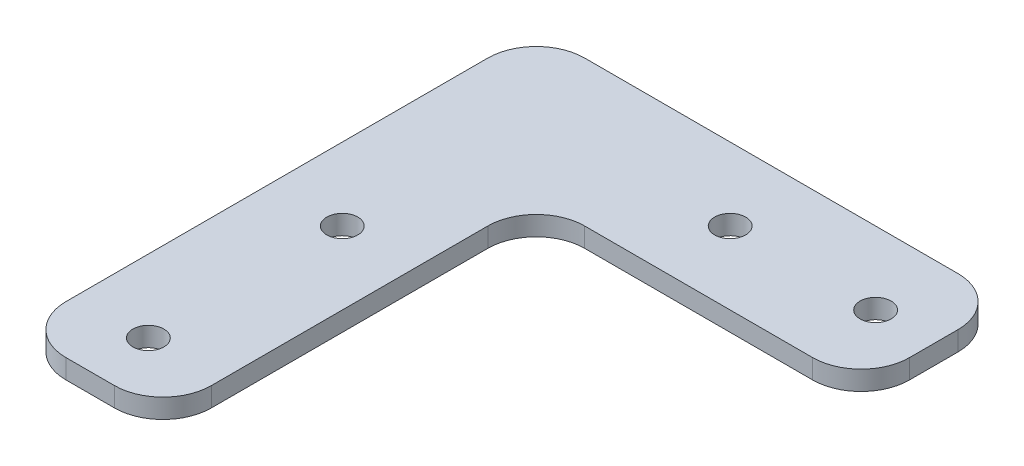
ISO-10303-21;
HEADER;
FILE_DESCRIPTION(('STEP AP214'),'2;1');
FILE_NAME('part.step','',(''),(''),'','','');
FILE_SCHEMA(('AUTOMOTIVE_DESIGN { 1 0 10303 214 1 1 1 1 }'));
ENDSEC;
DATA;
#1=APPLICATION_CONTEXT('core data for automotive mechanical design processes');
#2=APPLICATION_PROTOCOL_DEFINITION('international standard','automotive_design',2000,#1);
#3=PRODUCT_CONTEXT('',#1,'mechanical');
#4=PRODUCT('Part','Part','',(#3));
#5=PRODUCT_RELATED_PRODUCT_CATEGORY('part','',(#4));
#6=PRODUCT_DEFINITION_FORMATION('','',#4);
#7=PRODUCT_DEFINITION_CONTEXT('part definition',#1,'design');
#8=PRODUCT_DEFINITION('design','',#6,#7);
#9=PRODUCT_DEFINITION_SHAPE('','',#8);
#10=(LENGTH_UNIT() NAMED_UNIT(*) SI_UNIT(.MILLI.,.METRE.));
#11=(NAMED_UNIT(*) PLANE_ANGLE_UNIT() SI_UNIT($,.RADIAN.));
#12=(NAMED_UNIT(*) SI_UNIT($,.STERADIAN.) SOLID_ANGLE_UNIT());
#13=UNCERTAINTY_MEASURE_WITH_UNIT(LENGTH_MEASURE(1.E-05),#10,'distance_accuracy_value','');
#14=(GEOMETRIC_REPRESENTATION_CONTEXT(3) GLOBAL_UNCERTAINTY_ASSIGNED_CONTEXT((#13)) GLOBAL_UNIT_ASSIGNED_CONTEXT((#10,
#11,#12)) REPRESENTATION_CONTEXT('',''));
#15=CARTESIAN_POINT('',(0.,0.,0.));
#16=DIRECTION('',(0.,0.,1.));
#17=DIRECTION('',(1.,0.,0.));
#18=AXIS2_PLACEMENT_3D('',#15,#16,#17);
#19=CARTESIAN_POINT('',(0.,2.,0.));
#20=DIRECTION('',(0.,1.,0.));
#21=DIRECTION('',(0.,0.,1.));
#22=AXIS2_PLACEMENT_3D('',#19,#20,#21);
#23=PLANE('',#22);
#24=CARTESIAN_POINT('',(20.,2.,2.15105711021124E-13));
#25=DIRECTION('',(0.,1.,0.));
#26=DIRECTION('',(0.,0.,-1.));
#27=AXIS2_PLACEMENT_3D('',#24,#25,#26);
#28=CIRCLE('',#27,1.6);
#29=CARTESIAN_POINT('',(20.,2.,-1.59999999999979));
#30=VERTEX_POINT('',#29);
#31=EDGE_CURVE('E282',#30,#30,#28,.T.);
#32=ORIENTED_EDGE('',*,*,#31,.F.);
#33=EDGE_LOOP('',(#32));
#34=FACE_BOUND('',#33,.T.);
#35=CARTESIAN_POINT('',(0.,2.,40.));
#36=DIRECTION('',(0.,1.,0.));
#37=DIRECTION('',(0.,0.,1.));
#38=AXIS2_PLACEMENT_3D('',#35,#36,#37);
#39=CIRCLE('',#38,1.6);
#40=CARTESIAN_POINT('',(0.,2.,41.6));
#41=VERTEX_POINT('',#40);
#42=EDGE_CURVE('E244',#41,#41,#39,.T.);
#43=ORIENTED_EDGE('',*,*,#42,.F.);
#44=EDGE_LOOP('',(#43));
#45=FACE_BOUND('',#44,.T.);
#46=DIRECTION('',(1.,0.,0.));
#47=VECTOR('',#46,1.);
#48=CARTESIAN_POINT('',(7.5,2.,46.));
#49=LINE('',#48,#47);
#50=CARTESIAN_POINT('',(-2.5,2.,46.));
#51=VERTEX_POINT('',#50);
#52=CARTESIAN_POINT('',(2.5,2.,46.));
#53=VERTEX_POINT('',#52);
#54=EDGE_CURVE('E258',#51,#53,#49,.T.);
#55=ORIENTED_EDGE('',*,*,#54,.T.);
#56=CARTESIAN_POINT('',(2.5,2.,41.));
#57=DIRECTION('',(0.,1.,0.));
#58=DIRECTION('',(0.,0.,1.));
#59=AXIS2_PLACEMENT_3D('',#56,#57,#58);
#60=CIRCLE('',#59,5.);
#61=CARTESIAN_POINT('',(7.5,2.,41.));
#62=VERTEX_POINT('',#61);
#63=EDGE_CURVE('E195',#53,#62,#60,.T.);
#64=ORIENTED_EDGE('',*,*,#63,.T.);
#65=DIRECTION('',(0.,0.,-1.));
#66=VECTOR('',#65,1.);
#67=CARTESIAN_POINT('',(7.5,2.,7.50000000000007));
#68=LINE('',#67,#66);
#69=CARTESIAN_POINT('',(7.5,2.,12.5));
#70=VERTEX_POINT('',#69);
#71=EDGE_CURVE('E154',#62,#70,#68,.T.);
#72=ORIENTED_EDGE('',*,*,#71,.T.);
#73=CARTESIAN_POINT('',(12.5,2.,12.5));
#74=DIRECTION('',(0.,1.,0.));
#75=DIRECTION('',(0.,0.,1.));
#76=AXIS2_PLACEMENT_3D('',#73,#74,#75);
#77=CIRCLE('',#76,5.);
#78=CARTESIAN_POINT('',(12.5,2.,7.50000000000005));
#79=VERTEX_POINT('',#78);
#80=EDGE_CURVE('E11',#70,#79,#77,.F.);
#81=ORIENTED_EDGE('',*,*,#80,.T.);
#82=DIRECTION('',(1.,0.,0.));
#83=VECTOR('',#82,1.);
#84=CARTESIAN_POINT('',(7.5,2.,7.50000000000007));
#85=LINE('',#84,#83);
#86=CARTESIAN_POINT('',(36.,2.,7.49999999999994));
#87=VERTEX_POINT('',#86);
#88=EDGE_CURVE('E162',#79,#87,#85,.T.);
#89=ORIENTED_EDGE('',*,*,#88,.T.);
#90=CARTESIAN_POINT('',(36.,2.,2.49999999999994));
#91=DIRECTION('',(0.,1.,0.));
#92=DIRECTION('',(0.,0.,1.));
#93=AXIS2_PLACEMENT_3D('',#90,#91,#92);
#94=CIRCLE('',#93,5.);
#95=CARTESIAN_POINT('',(41.,2.,2.49999999999994));
#96=VERTEX_POINT('',#95);
#97=EDGE_CURVE('E187',#87,#96,#94,.T.);
#98=ORIENTED_EDGE('',*,*,#97,.T.);
#99=DIRECTION('',(0.,0.,-1.));
#100=VECTOR('',#99,1.);
#101=CARTESIAN_POINT('',(41.,2.,7.49999999999992));
#102=LINE('',#101,#100);
#103=CARTESIAN_POINT('',(41.,2.,-2.50000000000009));
#104=VERTEX_POINT('',#103);
#105=EDGE_CURVE('E170',#96,#104,#102,.T.);
#106=ORIENTED_EDGE('',*,*,#105,.T.);
#107=CARTESIAN_POINT('',(36.,2.,-2.50000000000008));
#108=DIRECTION('',(0.,1.,0.));
#109=DIRECTION('',(0.,0.,1.));
#110=AXIS2_PLACEMENT_3D('',#107,#108,#109);
#111=CIRCLE('',#110,5.);
#112=CARTESIAN_POINT('',(36.,2.,-7.50000000000008));
#113=VERTEX_POINT('',#112);
#114=EDGE_CURVE('E189',#104,#113,#111,.T.);
#115=ORIENTED_EDGE('',*,*,#114,.T.);
#116=DIRECTION('',(-1.,0.,0.));
#117=VECTOR('',#116,1.);
#118=CARTESIAN_POINT('',(41.,2.,-7.50000000000008));
#119=LINE('',#118,#117);
#120=CARTESIAN_POINT('',(-2.5,2.,-7.50000000000008));
#121=VERTEX_POINT('',#120);
#122=EDGE_CURVE('E265',#113,#121,#119,.T.);
#123=ORIENTED_EDGE('',*,*,#122,.T.);
#124=CARTESIAN_POINT('',(-2.5,2.,-2.50000000000008));
#125=DIRECTION('',(0.,1.,0.));
#126=DIRECTION('',(0.,0.,1.));
#127=AXIS2_PLACEMENT_3D('',#124,#125,#126);
#128=CIRCLE('',#127,5.);
#129=CARTESIAN_POINT('',(-7.5,2.,-2.50000000000008));
#130=VERTEX_POINT('',#129);
#131=EDGE_CURVE('E65',#121,#130,#128,.T.);
#132=ORIENTED_EDGE('',*,*,#131,.T.);
#133=DIRECTION('',(0.,0.,1.));
#134=VECTOR('',#133,1.);
#135=CARTESIAN_POINT('',(-7.5,2.,46.));
#136=LINE('',#135,#134);
#137=CARTESIAN_POINT('',(-7.5,2.,41.));
#138=VERTEX_POINT('',#137);
#139=EDGE_CURVE('E259',#130,#138,#136,.T.);
#140=ORIENTED_EDGE('',*,*,#139,.T.);
#141=CARTESIAN_POINT('',(-2.5,2.,41.));
#142=DIRECTION('',(0.,1.,0.));
#143=DIRECTION('',(0.,0.,1.));
#144=AXIS2_PLACEMENT_3D('',#141,#142,#143);
#145=CIRCLE('',#144,5.);
#146=EDGE_CURVE('E193',#138,#51,#145,.T.);
#147=ORIENTED_EDGE('',*,*,#146,.T.);
#148=EDGE_LOOP('',(#55,#64,#72,#81,#89,#98,#106,#115,#123,#132,#140,#147));
#149=FACE_BOUND('',#148,.T.);
#150=CARTESIAN_POINT('',(0.,2.,20.));
#151=DIRECTION('',(0.,1.,0.));
#152=DIRECTION('',(0.,0.,1.));
#153=AXIS2_PLACEMENT_3D('',#150,#151,#152);
#154=CIRCLE('',#153,1.6);
#155=CARTESIAN_POINT('',(0.,2.,21.6));
#156=VERTEX_POINT('',#155);
#157=EDGE_CURVE('E275',#156,#156,#154,.T.);
#158=ORIENTED_EDGE('',*,*,#157,.F.);
#159=EDGE_LOOP('',(#158));
#160=FACE_BOUND('',#159,.T.);
#161=CARTESIAN_POINT('',(35.,2.,1.83880688453542E-13));
#162=DIRECTION('',(0.,1.,0.));
#163=DIRECTION('',(0.,0.,-1.));
#164=AXIS2_PLACEMENT_3D('',#161,#162,#163);
#165=CIRCLE('',#164,1.6);
#166=CARTESIAN_POINT('',(35.,2.,-1.59999999999981));
#167=VERTEX_POINT('',#166);
#168=EDGE_CURVE('E289',#167,#167,#165,.T.);
#169=ORIENTED_EDGE('',*,*,#168,.F.);
#170=EDGE_LOOP('',(#169));
#171=FACE_BOUND('',#170,.T.);
#172=ADVANCED_FACE('F43',(#34,#45,#149,#160,#171),#23,.T.);
#173=CARTESIAN_POINT('',(0.,0.,0.));
#174=DIRECTION('',(0.,1.,0.));
#175=DIRECTION('',(0.,0.,1.));
#176=AXIS2_PLACEMENT_3D('',#173,#174,#175);
#177=PLANE('',#176);
#178=DIRECTION('',(0.,0.,-1.));
#179=VECTOR('',#178,1.);
#180=CARTESIAN_POINT('',(7.5,0.,7.50000000000007));
#181=LINE('',#180,#179);
#182=CARTESIAN_POINT('',(7.5,0.,41.));
#183=VERTEX_POINT('',#182);
#184=CARTESIAN_POINT('',(7.5,0.,12.5));
#185=VERTEX_POINT('',#184);
#186=EDGE_CURVE('E151',#183,#185,#181,.T.);
#187=ORIENTED_EDGE('',*,*,#186,.F.);
#188=CARTESIAN_POINT('',(2.5,0.,41.));
#189=DIRECTION('',(0.,1.,0.));
#190=DIRECTION('',(0.,0.,1.));
#191=AXIS2_PLACEMENT_3D('',#188,#189,#190);
#192=CIRCLE('',#191,5.);
#193=CARTESIAN_POINT('',(2.5,0.,46.));
#194=VERTEX_POINT('',#193);
#195=EDGE_CURVE('E133',#183,#194,#192,.F.);
#196=ORIENTED_EDGE('',*,*,#195,.T.);
#197=DIRECTION('',(1.,0.,0.));
#198=VECTOR('',#197,1.);
#199=CARTESIAN_POINT('',(7.5,0.,46.));
#200=LINE('',#199,#198);
#201=CARTESIAN_POINT('',(-2.5,0.,46.));
#202=VERTEX_POINT('',#201);
#203=EDGE_CURVE('E163',#202,#194,#200,.T.);
#204=ORIENTED_EDGE('',*,*,#203,.F.);
#205=CARTESIAN_POINT('',(-2.5,0.,41.));
#206=DIRECTION('',(0.,1.,0.));
#207=DIRECTION('',(0.,0.,1.));
#208=AXIS2_PLACEMENT_3D('',#205,#206,#207);
#209=CIRCLE('',#208,5.);
#210=CARTESIAN_POINT('',(-7.5,0.,41.));
#211=VERTEX_POINT('',#210);
#212=EDGE_CURVE('E145',#202,#211,#209,.F.);
#213=ORIENTED_EDGE('',*,*,#212,.T.);
#214=DIRECTION('',(0.,0.,1.));
#215=VECTOR('',#214,1.);
#216=CARTESIAN_POINT('',(-7.5,0.,46.));
#217=LINE('',#216,#215);
#218=CARTESIAN_POINT('',(-7.5,0.,-2.50000000000008));
#219=VERTEX_POINT('',#218);
#220=EDGE_CURVE('E172',#219,#211,#217,.T.);
#221=ORIENTED_EDGE('',*,*,#220,.F.);
#222=CARTESIAN_POINT('',(-2.5,0.,-2.50000000000008));
#223=DIRECTION('',(0.,1.,0.));
#224=DIRECTION('',(0.,0.,1.));
#225=AXIS2_PLACEMENT_3D('',#222,#223,#224);
#226=CIRCLE('',#225,5.);
#227=CARTESIAN_POINT('',(-2.5,0.,-7.50000000000008));
#228=VERTEX_POINT('',#227);
#229=EDGE_CURVE('E180',#219,#228,#226,.F.);
#230=ORIENTED_EDGE('',*,*,#229,.T.);
#231=DIRECTION('',(-1.,0.,0.));
#232=VECTOR('',#231,1.);
#233=CARTESIAN_POINT('',(41.,0.,-7.50000000000008));
#234=LINE('',#233,#232);
#235=CARTESIAN_POINT('',(36.,0.,-7.50000000000008));
#236=VERTEX_POINT('',#235);
#237=EDGE_CURVE('E238',#236,#228,#234,.T.);
#238=ORIENTED_EDGE('',*,*,#237,.F.);
#239=CARTESIAN_POINT('',(36.,0.,-2.50000000000008));
#240=DIRECTION('',(0.,1.,0.));
#241=DIRECTION('',(0.,0.,1.));
#242=AXIS2_PLACEMENT_3D('',#239,#240,#241);
#243=CIRCLE('',#242,5.);
#244=CARTESIAN_POINT('',(41.,0.,-2.50000000000009));
#245=VERTEX_POINT('',#244);
#246=EDGE_CURVE('E178',#236,#245,#243,.F.);
#247=ORIENTED_EDGE('',*,*,#246,.T.);
#248=DIRECTION('',(0.,0.,-1.));
#249=VECTOR('',#248,1.);
#250=CARTESIAN_POINT('',(41.,0.,7.49999999999992));
#251=LINE('',#250,#249);
#252=CARTESIAN_POINT('',(41.,0.,2.49999999999994));
#253=VERTEX_POINT('',#252);
#254=EDGE_CURVE('E235',#253,#245,#251,.T.);
#255=ORIENTED_EDGE('',*,*,#254,.F.);
#256=CARTESIAN_POINT('',(36.,0.,2.49999999999994));
#257=DIRECTION('',(0.,1.,0.));
#258=DIRECTION('',(0.,0.,1.));
#259=AXIS2_PLACEMENT_3D('',#256,#257,#258);
#260=CIRCLE('',#259,5.);
#261=CARTESIAN_POINT('',(36.,0.,7.49999999999994));
#262=VERTEX_POINT('',#261);
#263=EDGE_CURVE('E155',#253,#262,#260,.F.);
#264=ORIENTED_EDGE('',*,*,#263,.T.);
#265=DIRECTION('',(1.,0.,0.));
#266=VECTOR('',#265,1.);
#267=CARTESIAN_POINT('',(7.5,0.,7.50000000000007));
#268=LINE('',#267,#266);
#269=CARTESIAN_POINT('',(12.5,0.,7.50000000000005));
#270=VERTEX_POINT('',#269);
#271=EDGE_CURVE('E221',#270,#262,#268,.T.);
#272=ORIENTED_EDGE('',*,*,#271,.F.);
#273=CARTESIAN_POINT('',(12.5,0.,12.5));
#274=DIRECTION('',(0.,1.,0.));
#275=DIRECTION('',(0.,0.,1.));
#276=AXIS2_PLACEMENT_3D('',#273,#274,#275);
#277=CIRCLE('',#276,5.);
#278=EDGE_CURVE('E51',#270,#185,#277,.T.);
#279=ORIENTED_EDGE('',*,*,#278,.T.);
#280=EDGE_LOOP('',(#187,#196,#204,#213,#221,#230,#238,#247,#255,#264,#272,#279));
#281=FACE_BOUND('',#280,.T.);
#282=CARTESIAN_POINT('',(0.,0.,40.));
#283=DIRECTION('',(0.,1.,0.));
#284=DIRECTION('',(0.,0.,1.));
#285=AXIS2_PLACEMENT_3D('',#282,#283,#284);
#286=CIRCLE('',#285,1.6);
#287=CARTESIAN_POINT('',(0.,0.,41.6));
#288=VERTEX_POINT('',#287);
#289=EDGE_CURVE('E271',#288,#288,#286,.T.);
#290=ORIENTED_EDGE('',*,*,#289,.T.);
#291=EDGE_LOOP('',(#290));
#292=FACE_BOUND('',#291,.T.);
#293=CARTESIAN_POINT('',(0.,0.,20.));
#294=DIRECTION('',(0.,1.,0.));
#295=DIRECTION('',(0.,0.,1.));
#296=AXIS2_PLACEMENT_3D('',#293,#294,#295);
#297=CIRCLE('',#296,1.6);
#298=CARTESIAN_POINT('',(0.,0.,21.6));
#299=VERTEX_POINT('',#298);
#300=EDGE_CURVE('E279',#299,#299,#297,.T.);
#301=ORIENTED_EDGE('',*,*,#300,.T.);
#302=EDGE_LOOP('',(#301));
#303=FACE_BOUND('',#302,.T.);
#304=CARTESIAN_POINT('',(20.,0.,2.15105711021124E-13));
#305=DIRECTION('',(0.,1.,0.));
#306=DIRECTION('',(0.,0.,-1.));
#307=AXIS2_PLACEMENT_3D('',#304,#305,#306);
#308=CIRCLE('',#307,1.6);
#309=CARTESIAN_POINT('',(20.,0.,-1.59999999999979));
#310=VERTEX_POINT('',#309);
#311=EDGE_CURVE('E286',#310,#310,#308,.T.);
#312=ORIENTED_EDGE('',*,*,#311,.T.);
#313=EDGE_LOOP('',(#312));
#314=FACE_BOUND('',#313,.T.);
#315=CARTESIAN_POINT('',(35.,0.,1.83880688453542E-13));
#316=DIRECTION('',(0.,1.,0.));
#317=DIRECTION('',(0.,0.,-1.));
#318=AXIS2_PLACEMENT_3D('',#315,#316,#317);
#319=CIRCLE('',#318,1.6);
#320=CARTESIAN_POINT('',(35.,0.,-1.59999999999981));
#321=VERTEX_POINT('',#320);
#322=EDGE_CURVE('E293',#321,#321,#319,.T.);
#323=ORIENTED_EDGE('',*,*,#322,.T.);
#324=EDGE_LOOP('',(#323));
#325=FACE_BOUND('',#324,.T.);
#326=ADVANCED_FACE('F158',(#281,#292,#303,#314,#325),#177,.F.);
#327=CARTESIAN_POINT('',(7.5,2.,7.50000000000007));
#328=DIRECTION('',(0.,0.,-1.));
#329=DIRECTION('',(-1.,0.,0.));
#330=AXIS2_PLACEMENT_3D('',#327,#328,#329);
#331=PLANE('',#330);
#332=ORIENTED_EDGE('',*,*,#271,.T.);
#333=DIRECTION('',(0.,-1.,0.));
#334=VECTOR('',#333,1.);
#335=CARTESIAN_POINT('',(36.,2.,7.49999999999994));
#336=LINE('',#335,#334);
#337=EDGE_CURVE('E214',#262,#87,#336,.F.);
#338=ORIENTED_EDGE('',*,*,#337,.T.);
#339=ORIENTED_EDGE('',*,*,#88,.F.);
#340=DIRECTION('',(0.,-1.,0.));
#341=VECTOR('',#340,1.);
#342=CARTESIAN_POINT('',(12.5,0.,7.50000000000005));
#343=LINE('',#342,#341);
#344=EDGE_CURVE('E211',#79,#270,#343,.T.);
#345=ORIENTED_EDGE('',*,*,#344,.T.);
#346=EDGE_LOOP('',(#332,#338,#339,#345));
#347=FACE_BOUND('',#346,.T.);
#348=ADVANCED_FACE('F219',(#347),#331,.F.);
#349=CARTESIAN_POINT('',(41.,2.,7.49999999999992));
#350=DIRECTION('',(-1.,0.,0.));
#351=DIRECTION('',(0.,0.,1.));
#352=AXIS2_PLACEMENT_3D('',#349,#350,#351);
#353=PLANE('',#352);
#354=ORIENTED_EDGE('',*,*,#254,.T.);
#355=DIRECTION('',(0.,-1.,0.));
#356=VECTOR('',#355,1.);
#357=CARTESIAN_POINT('',(41.,2.,-2.50000000000009));
#358=LINE('',#357,#356);
#359=EDGE_CURVE('E209',#245,#104,#358,.F.);
#360=ORIENTED_EDGE('',*,*,#359,.T.);
#361=ORIENTED_EDGE('',*,*,#105,.F.);
#362=DIRECTION('',(0.,-1.,0.));
#363=VECTOR('',#362,1.);
#364=CARTESIAN_POINT('',(41.,2.,2.49999999999994));
#365=LINE('',#364,#363);
#366=EDGE_CURVE('E206',#96,#253,#365,.T.);
#367=ORIENTED_EDGE('',*,*,#366,.T.);
#368=EDGE_LOOP('',(#354,#360,#361,#367));
#369=FACE_BOUND('',#368,.T.);
#370=ADVANCED_FACE('F234',(#369),#353,.F.);
#371=CARTESIAN_POINT('',(41.,2.,-7.50000000000008));
#372=DIRECTION('',(0.,0.,1.));
#373=DIRECTION('',(1.,0.,0.));
#374=AXIS2_PLACEMENT_3D('',#371,#372,#373);
#375=PLANE('',#374);
#376=ORIENTED_EDGE('',*,*,#237,.T.);
#377=DIRECTION('',(0.,-1.,0.));
#378=VECTOR('',#377,1.);
#379=CARTESIAN_POINT('',(-2.5,2.,-7.50000000000008));
#380=LINE('',#379,#378);
#381=EDGE_CURVE('E204',#228,#121,#380,.F.);
#382=ORIENTED_EDGE('',*,*,#381,.T.);
#383=ORIENTED_EDGE('',*,*,#122,.F.);
#384=DIRECTION('',(0.,-1.,0.));
#385=VECTOR('',#384,1.);
#386=CARTESIAN_POINT('',(36.,2.,-7.50000000000008));
#387=LINE('',#386,#385);
#388=EDGE_CURVE('E201',#113,#236,#387,.T.);
#389=ORIENTED_EDGE('',*,*,#388,.T.);
#390=EDGE_LOOP('',(#376,#382,#383,#389));
#391=FACE_BOUND('',#390,.T.);
#392=ADVANCED_FACE('F323',(#391),#375,.F.);
#393=CARTESIAN_POINT('',(-7.5,2.,46.));
#394=DIRECTION('',(1.,0.,0.));
#395=DIRECTION('',(0.,0.,-1.));
#396=AXIS2_PLACEMENT_3D('',#393,#394,#395);
#397=PLANE('',#396);
#398=ORIENTED_EDGE('',*,*,#220,.T.);
#399=DIRECTION('',(0.,-1.,0.));
#400=VECTOR('',#399,1.);
#401=CARTESIAN_POINT('',(-7.5,2.,41.));
#402=LINE('',#401,#400);
#403=EDGE_CURVE('E58',#211,#138,#402,.F.);
#404=ORIENTED_EDGE('',*,*,#403,.T.);
#405=ORIENTED_EDGE('',*,*,#139,.F.);
#406=DIRECTION('',(0.,-1.,0.));
#407=VECTOR('',#406,1.);
#408=CARTESIAN_POINT('',(-7.5,2.,-2.50000000000008));
#409=LINE('',#408,#407);
#410=EDGE_CURVE('E197',#130,#219,#409,.T.);
#411=ORIENTED_EDGE('',*,*,#410,.T.);
#412=EDGE_LOOP('',(#398,#404,#405,#411));
#413=FACE_BOUND('',#412,.T.);
#414=ADVANCED_FACE('F251',(#413),#397,.F.);
#415=CARTESIAN_POINT('',(7.5,2.,46.));
#416=DIRECTION('',(0.,0.,-1.));
#417=DIRECTION('',(-1.,0.,0.));
#418=AXIS2_PLACEMENT_3D('',#415,#416,#417);
#419=PLANE('',#418);
#420=ORIENTED_EDGE('',*,*,#203,.T.);
#421=DIRECTION('',(0.,-1.,0.));
#422=VECTOR('',#421,1.);
#423=CARTESIAN_POINT('',(2.5,2.,46.));
#424=LINE('',#423,#422);
#425=EDGE_CURVE('E138',#194,#53,#424,.F.);
#426=ORIENTED_EDGE('',*,*,#425,.T.);
#427=ORIENTED_EDGE('',*,*,#54,.F.);
#428=DIRECTION('',(0.,-1.,0.));
#429=VECTOR('',#428,1.);
#430=CARTESIAN_POINT('',(-2.5,2.,46.));
#431=LINE('',#430,#429);
#432=EDGE_CURVE('E144',#51,#202,#431,.T.);
#433=ORIENTED_EDGE('',*,*,#432,.T.);
#434=EDGE_LOOP('',(#420,#426,#427,#433));
#435=FACE_BOUND('',#434,.T.);
#436=ADVANCED_FACE('F261',(#435),#419,.F.);
#437=CARTESIAN_POINT('',(7.5,2.,7.50000000000007));
#438=DIRECTION('',(-1.,0.,0.));
#439=DIRECTION('',(0.,0.,1.));
#440=AXIS2_PLACEMENT_3D('',#437,#438,#439);
#441=PLANE('',#440);
#442=ORIENTED_EDGE('',*,*,#71,.F.);
#443=DIRECTION('',(0.,-1.,0.));
#444=VECTOR('',#443,1.);
#445=CARTESIAN_POINT('',(7.5,2.,41.));
#446=LINE('',#445,#444);
#447=EDGE_CURVE('E137',#62,#183,#446,.T.);
#448=ORIENTED_EDGE('',*,*,#447,.T.);
#449=ORIENTED_EDGE('',*,*,#186,.T.);
#450=DIRECTION('',(0.,-1.,0.));
#451=VECTOR('',#450,1.);
#452=CARTESIAN_POINT('',(7.5,2.,12.5));
#453=LINE('',#452,#451);
#454=EDGE_CURVE('E156',#185,#70,#453,.F.);
#455=ORIENTED_EDGE('',*,*,#454,.T.);
#456=EDGE_LOOP('',(#442,#448,#449,#455));
#457=FACE_BOUND('',#456,.T.);
#458=ADVANCED_FACE('F150',(#457),#441,.F.);
#459=CARTESIAN_POINT('',(0.,2.,40.));
#460=DIRECTION('',(0.,-1.,0.));
#461=DIRECTION('',(0.,0.,-1.));
#462=AXIS2_PLACEMENT_3D('',#459,#460,#461);
#463=CYLINDRICAL_SURFACE('',#462,1.6);
#464=ORIENTED_EDGE('',*,*,#42,.T.);
#465=EDGE_LOOP('',(#464));
#466=FACE_BOUND('',#465,.T.);
#467=ORIENTED_EDGE('',*,*,#289,.F.);
#468=EDGE_LOOP('',(#467));
#469=FACE_BOUND('',#468,.T.);
#470=ADVANCED_FACE('F315',(#466,#469),#463,.F.);
#471=CARTESIAN_POINT('',(0.,2.,20.));
#472=DIRECTION('',(0.,-1.,0.));
#473=DIRECTION('',(0.,0.,-1.));
#474=AXIS2_PLACEMENT_3D('',#471,#472,#473);
#475=CYLINDRICAL_SURFACE('',#474,1.6);
#476=ORIENTED_EDGE('',*,*,#157,.T.);
#477=EDGE_LOOP('',(#476));
#478=FACE_BOUND('',#477,.T.);
#479=ORIENTED_EDGE('',*,*,#300,.F.);
#480=EDGE_LOOP('',(#479));
#481=FACE_BOUND('',#480,.T.);
#482=ADVANCED_FACE('F453',(#478,#481),#475,.F.);
#483=CARTESIAN_POINT('',(20.,2.,2.15105711021124E-13));
#484=DIRECTION('',(0.,-1.,0.));
#485=DIRECTION('',(0.,0.,-1.));
#486=AXIS2_PLACEMENT_3D('',#483,#484,#485);
#487=CYLINDRICAL_SURFACE('',#486,1.6);
#488=ORIENTED_EDGE('',*,*,#31,.T.);
#489=EDGE_LOOP('',(#488));
#490=FACE_BOUND('',#489,.T.);
#491=ORIENTED_EDGE('',*,*,#311,.F.);
#492=EDGE_LOOP('',(#491));
#493=FACE_BOUND('',#492,.T.);
#494=ADVANCED_FACE('F444',(#490,#493),#487,.F.);
#495=CARTESIAN_POINT('',(35.,2.,1.83880688453542E-13));
#496=DIRECTION('',(0.,-1.,0.));
#497=DIRECTION('',(0.,0.,-1.));
#498=AXIS2_PLACEMENT_3D('',#495,#496,#497);
#499=CYLINDRICAL_SURFACE('',#498,1.6);
#500=ORIENTED_EDGE('',*,*,#168,.T.);
#501=EDGE_LOOP('',(#500));
#502=FACE_BOUND('',#501,.T.);
#503=ORIENTED_EDGE('',*,*,#322,.F.);
#504=EDGE_LOOP('',(#503));
#505=FACE_BOUND('',#504,.T.);
#506=ADVANCED_FACE('F301',(#502,#505),#499,.F.);
#507=CARTESIAN_POINT('',(2.5,2.,41.));
#508=DIRECTION('',(0.,-1.,0.));
#509=DIRECTION('',(0.,0.,-1.));
#510=AXIS2_PLACEMENT_3D('',#507,#508,#509);
#511=CYLINDRICAL_SURFACE('',#510,5.);
#512=ORIENTED_EDGE('',*,*,#63,.F.);
#513=ORIENTED_EDGE('',*,*,#425,.F.);
#514=ORIENTED_EDGE('',*,*,#195,.F.);
#515=ORIENTED_EDGE('',*,*,#447,.F.);
#516=EDGE_LOOP('',(#512,#513,#514,#515));
#517=FACE_BOUND('',#516,.T.);
#518=ADVANCED_FACE('F136',(#517),#511,.T.);
#519=CARTESIAN_POINT('',(-2.5,2.,41.));
#520=DIRECTION('',(0.,-1.,0.));
#521=DIRECTION('',(0.,0.,-1.));
#522=AXIS2_PLACEMENT_3D('',#519,#520,#521);
#523=CYLINDRICAL_SURFACE('',#522,5.);
#524=ORIENTED_EDGE('',*,*,#146,.F.);
#525=ORIENTED_EDGE('',*,*,#403,.F.);
#526=ORIENTED_EDGE('',*,*,#212,.F.);
#527=ORIENTED_EDGE('',*,*,#432,.F.);
#528=EDGE_LOOP('',(#524,#525,#526,#527));
#529=FACE_BOUND('',#528,.T.);
#530=ADVANCED_FACE('F255',(#529),#523,.T.);
#531=CARTESIAN_POINT('',(-2.5,2.,-2.50000000000008));
#532=DIRECTION('',(0.,-1.,0.));
#533=DIRECTION('',(0.,0.,-1.));
#534=AXIS2_PLACEMENT_3D('',#531,#532,#533);
#535=CYLINDRICAL_SURFACE('',#534,5.);
#536=ORIENTED_EDGE('',*,*,#131,.F.);
#537=ORIENTED_EDGE('',*,*,#381,.F.);
#538=ORIENTED_EDGE('',*,*,#229,.F.);
#539=ORIENTED_EDGE('',*,*,#410,.F.);
#540=EDGE_LOOP('',(#536,#537,#538,#539));
#541=FACE_BOUND('',#540,.T.);
#542=ADVANCED_FACE('F335',(#541),#535,.T.);
#543=CARTESIAN_POINT('',(36.,2.,-2.50000000000008));
#544=DIRECTION('',(0.,-1.,0.));
#545=DIRECTION('',(0.,0.,-1.));
#546=AXIS2_PLACEMENT_3D('',#543,#544,#545);
#547=CYLINDRICAL_SURFACE('',#546,5.);
#548=ORIENTED_EDGE('',*,*,#114,.F.);
#549=ORIENTED_EDGE('',*,*,#359,.F.);
#550=ORIENTED_EDGE('',*,*,#246,.F.);
#551=ORIENTED_EDGE('',*,*,#388,.F.);
#552=EDGE_LOOP('',(#548,#549,#550,#551));
#553=FACE_BOUND('',#552,.T.);
#554=ADVANCED_FACE('F338',(#553),#547,.T.);
#555=CARTESIAN_POINT('',(36.,2.,2.49999999999994));
#556=DIRECTION('',(0.,-1.,0.));
#557=DIRECTION('',(0.,0.,-1.));
#558=AXIS2_PLACEMENT_3D('',#555,#556,#557);
#559=CYLINDRICAL_SURFACE('',#558,5.);
#560=ORIENTED_EDGE('',*,*,#97,.F.);
#561=ORIENTED_EDGE('',*,*,#337,.F.);
#562=ORIENTED_EDGE('',*,*,#263,.F.);
#563=ORIENTED_EDGE('',*,*,#366,.F.);
#564=EDGE_LOOP('',(#560,#561,#562,#563));
#565=FACE_BOUND('',#564,.T.);
#566=ADVANCED_FACE('F230',(#565),#559,.T.);
#567=CARTESIAN_POINT('',(12.5,2.,12.5));
#568=DIRECTION('',(0.,1.,0.));
#569=DIRECTION('',(0.,0.,1.));
#570=AXIS2_PLACEMENT_3D('',#567,#568,#569);
#571=CYLINDRICAL_SURFACE('',#570,5.);
#572=ORIENTED_EDGE('',*,*,#80,.F.);
#573=ORIENTED_EDGE('',*,*,#454,.F.);
#574=ORIENTED_EDGE('',*,*,#278,.F.);
#575=ORIENTED_EDGE('',*,*,#344,.F.);
#576=EDGE_LOOP('',(#572,#573,#574,#575));
#577=FACE_BOUND('',#576,.T.);
#578=ADVANCED_FACE('F45',(#577),#571,.F.);
#579=CLOSED_SHELL('',(#172,#326,#348,#370,#392,#414,#436,#458,#470,#482,#494,#506,#518,#530,
#542,#554,#566,#578));
#580=MANIFOLD_SOLID_BREP('B2',#579);
#581=ADVANCED_BREP_SHAPE_REPRESENTATION('',(#18,#580),#14);
#582=SHAPE_DEFINITION_REPRESENTATION(#9,#581);
ENDSEC;
END-ISO-10303-21;
